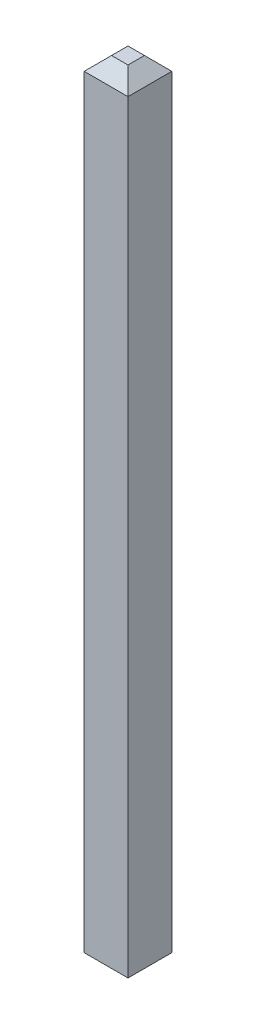
ISO-10303-21;
HEADER;
FILE_DESCRIPTION(('STEP AP214'),'2;1');
FILE_NAME('part.step','',(''),(''),'','','');
FILE_SCHEMA(('AUTOMOTIVE_DESIGN { 1 0 10303 214 1 1 1 1 }'));
ENDSEC;
DATA;
#1=APPLICATION_CONTEXT('core data for automotive mechanical design processes');
#2=APPLICATION_PROTOCOL_DEFINITION('international standard','automotive_design',2000,#1);
#3=PRODUCT_CONTEXT('',#1,'mechanical');
#4=PRODUCT('Part','Part','',(#3));
#5=PRODUCT_RELATED_PRODUCT_CATEGORY('part','',(#4));
#6=PRODUCT_DEFINITION_FORMATION('','',#4);
#7=PRODUCT_DEFINITION_CONTEXT('part definition',#1,'design');
#8=PRODUCT_DEFINITION('design','',#6,#7);
#9=PRODUCT_DEFINITION_SHAPE('','',#8);
#10=(LENGTH_UNIT() NAMED_UNIT(*) SI_UNIT(.MILLI.,.METRE.));
#11=(NAMED_UNIT(*) PLANE_ANGLE_UNIT() SI_UNIT($,.RADIAN.));
#12=(NAMED_UNIT(*) SI_UNIT($,.STERADIAN.) SOLID_ANGLE_UNIT());
#13=UNCERTAINTY_MEASURE_WITH_UNIT(LENGTH_MEASURE(1.E-05),#10,'distance_accuracy_value','');
#14=(GEOMETRIC_REPRESENTATION_CONTEXT(3) GLOBAL_UNCERTAINTY_ASSIGNED_CONTEXT((#13)) GLOBAL_UNIT_ASSIGNED_CONTEXT((#10,
#11,#12)) REPRESENTATION_CONTEXT('',''));
#15=CARTESIAN_POINT('',(0.,0.,0.));
#16=DIRECTION('',(0.,0.,1.));
#17=DIRECTION('',(1.,0.,0.));
#18=AXIS2_PLACEMENT_3D('',#15,#16,#17);
#19=CARTESIAN_POINT('',(-0.95,7.07,-0.32));
#20=DIRECTION('',(-0.707106781186548,-0.707106781186548,0.));
#21=DIRECTION('',(-0.707106781186548,0.707106781186548,0.));
#22=AXIS2_PLACEMENT_3D('',#19,#20,#21);
#23=PLANE('',#22);
#24=DIRECTION('',(0.577350269189626,-0.577350269189626,0.577350269189626));
#25=VECTOR('',#24,1.);
#26=CARTESIAN_POINT('',(-1.163333333333,7.283333333333,0.106666666667));
#27=LINE('',#26,#25);
#28=CARTESIAN_POINT('',(-1.15,7.27,0.12));
#29=VERTEX_POINT('',#28);
#30=CARTESIAN_POINT('',(-0.95,7.07,0.32));
#31=VERTEX_POINT('',#30);
#32=EDGE_CURVE('E190',#29,#31,#27,.T.);
#33=ORIENTED_EDGE('',*,*,#32,.T.);
#34=DIRECTION('',(0.,0.,1.));
#35=VECTOR('',#34,1.);
#36=CARTESIAN_POINT('',(-0.95,7.07,-0.32));
#37=LINE('',#36,#35);
#38=CARTESIAN_POINT('',(-0.95,7.07,-0.32));
#39=VERTEX_POINT('',#38);
#40=EDGE_CURVE('E80',#39,#31,#37,.T.);
#41=ORIENTED_EDGE('',*,*,#40,.F.);
#42=DIRECTION('',(0.577350269189626,-0.577350269189626,-0.577350269189626));
#43=VECTOR('',#42,1.);
#44=CARTESIAN_POINT('',(-0.95,7.07,-0.32));
#45=LINE('',#44,#43);
#46=CARTESIAN_POINT('',(-1.15,7.27,-0.12));
#47=VERTEX_POINT('',#46);
#48=EDGE_CURVE('E11',#47,#39,#45,.T.);
#49=ORIENTED_EDGE('',*,*,#48,.F.);
#50=DIRECTION('',(0.,0.,-1.));
#51=VECTOR('',#50,1.);
#52=CARTESIAN_POINT('',(-1.15,7.27,-0.32));
#53=LINE('',#52,#51);
#54=EDGE_CURVE('E129',#29,#47,#53,.T.);
#55=ORIENTED_EDGE('',*,*,#54,.F.);
#56=EDGE_LOOP('',(#33,#41,#49,#55));
#57=FACE_BOUND('',#56,.T.);
#58=ADVANCED_FACE('F16',(#57),#23,.F.);
#59=CARTESIAN_POINT('',(-1.27,7.07,-0.32));
#60=DIRECTION('',(0.,0.707106781186548,-0.707106781186548));
#61=DIRECTION('',(-1.,0.,0.));
#62=AXIS2_PLACEMENT_3D('',#59,#60,#61);
#63=PLANE('',#62);
#64=DIRECTION('',(0.577350269189626,0.577350269189626,0.577350269189626));
#65=VECTOR('',#64,1.);
#66=CARTESIAN_POINT('',(-1.456666666667,7.203333333333,-0.186666666667));
#67=LINE('',#66,#65);
#68=CARTESIAN_POINT('',(-1.59,7.07,-0.32));
#69=VERTEX_POINT('',#68);
#70=CARTESIAN_POINT('',(-1.39,7.27,-0.12));
#71=VERTEX_POINT('',#70);
#72=EDGE_CURVE('E26',#69,#71,#67,.T.);
#73=ORIENTED_EDGE('',*,*,#72,.T.);
#74=DIRECTION('',(-1.,0.,0.));
#75=VECTOR('',#74,1.);
#76=CARTESIAN_POINT('',(-1.59,7.27,-0.12));
#77=LINE('',#76,#75);
#78=EDGE_CURVE('E132',#47,#71,#77,.T.);
#79=ORIENTED_EDGE('',*,*,#78,.F.);
#80=ORIENTED_EDGE('',*,*,#48,.T.);
#81=DIRECTION('',(1.,0.,0.));
#82=VECTOR('',#81,1.);
#83=CARTESIAN_POINT('',(-0.95,7.07,-0.32));
#84=LINE('',#83,#82);
#85=EDGE_CURVE('E149',#69,#39,#84,.T.);
#86=ORIENTED_EDGE('',*,*,#85,.F.);
#87=EDGE_LOOP('',(#73,#79,#80,#86));
#88=FACE_BOUND('',#87,.T.);
#89=ADVANCED_FACE('F238',(#88),#63,.T.);
#90=CARTESIAN_POINT('',(-1.39,7.27,-0.32));
#91=DIRECTION('',(0.707106781186548,-0.707106781186548,0.));
#92=DIRECTION('',(0.,0.,-1.));
#93=AXIS2_PLACEMENT_3D('',#90,#91,#92);
#94=PLANE('',#93);
#95=DIRECTION('',(-0.577350269189626,-0.577350269189626,0.577350269189626));
#96=VECTOR('',#95,1.);
#97=CARTESIAN_POINT('',(-1.456666666667,7.203333333333,0.186666666667));
#98=LINE('',#97,#96);
#99=CARTESIAN_POINT('',(-1.39,7.27,0.12));
#100=VERTEX_POINT('',#99);
#101=CARTESIAN_POINT('',(-1.59,7.07,0.32));
#102=VERTEX_POINT('',#101);
#103=EDGE_CURVE('E39',#100,#102,#98,.T.);
#104=ORIENTED_EDGE('',*,*,#103,.F.);
#105=DIRECTION('',(0.,0.,1.));
#106=VECTOR('',#105,1.);
#107=CARTESIAN_POINT('',(-1.39,7.27,-0.32));
#108=LINE('',#107,#106);
#109=EDGE_CURVE('E144',#71,#100,#108,.T.);
#110=ORIENTED_EDGE('',*,*,#109,.F.);
#111=ORIENTED_EDGE('',*,*,#72,.F.);
#112=DIRECTION('',(0.,0.,-1.));
#113=VECTOR('',#112,1.);
#114=CARTESIAN_POINT('',(-1.59,7.07,-0.32));
#115=LINE('',#114,#113);
#116=EDGE_CURVE('E163',#102,#69,#115,.T.);
#117=ORIENTED_EDGE('',*,*,#116,.F.);
#118=EDGE_LOOP('',(#104,#110,#111,#117));
#119=FACE_BOUND('',#118,.T.);
#120=ADVANCED_FACE('F249',(#119),#94,.F.);
#121=CARTESIAN_POINT('',(-1.59,7.27,0.12));
#122=DIRECTION('',(0.,-0.707106781186548,-0.707106781186548));
#123=DIRECTION('',(0.,-0.707106781186548,0.707106781186548));
#124=AXIS2_PLACEMENT_3D('',#121,#122,#123);
#125=PLANE('',#124);
#126=ORIENTED_EDGE('',*,*,#32,.F.);
#127=DIRECTION('',(1.,0.,0.));
#128=VECTOR('',#127,1.);
#129=CARTESIAN_POINT('',(-1.59,7.27,0.12));
#130=LINE('',#129,#128);
#131=EDGE_CURVE('E125',#100,#29,#130,.T.);
#132=ORIENTED_EDGE('',*,*,#131,.F.);
#133=ORIENTED_EDGE('',*,*,#103,.T.);
#134=DIRECTION('',(-1.,0.,0.));
#135=VECTOR('',#134,1.);
#136=CARTESIAN_POINT('',(-1.27,7.07,0.32));
#137=LINE('',#136,#135);
#138=EDGE_CURVE('E86',#31,#102,#137,.T.);
#139=ORIENTED_EDGE('',*,*,#138,.F.);
#140=EDGE_LOOP('',(#126,#132,#133,#139));
#141=FACE_BOUND('',#140,.T.);
#142=ADVANCED_FACE('F241',(#141),#125,.F.);
#143=CARTESIAN_POINT('',(-1.59,7.27,-0.32));
#144=DIRECTION('',(0.,-1.,0.));
#145=DIRECTION('',(0.,0.,-1.));
#146=AXIS2_PLACEMENT_3D('',#143,#144,#145);
#147=PLANE('',#146);
#148=ORIENTED_EDGE('',*,*,#54,.T.);
#149=ORIENTED_EDGE('',*,*,#78,.T.);
#150=ORIENTED_EDGE('',*,*,#109,.T.);
#151=ORIENTED_EDGE('',*,*,#131,.T.);
#152=EDGE_LOOP('',(#148,#149,#150,#151));
#153=FACE_BOUND('',#152,.T.);
#154=ADVANCED_FACE('F239',(#153),#147,.F.);
#155=CARTESIAN_POINT('',(-0.95,7.27,-0.32));
#156=DIRECTION('',(-1.,0.,0.));
#157=DIRECTION('',(0.,1.,0.));
#158=AXIS2_PLACEMENT_3D('',#155,#156,#157);
#159=PLANE('',#158);
#160=DIRECTION('',(0.,-1.,0.));
#161=VECTOR('',#160,1.);
#162=CARTESIAN_POINT('',(-0.95,7.27,-0.32));
#163=LINE('',#162,#161);
#164=CARTESIAN_POINT('',(-0.95,-4.07,-0.32));
#165=VERTEX_POINT('',#164);
#166=EDGE_CURVE('E175',#39,#165,#163,.T.);
#167=ORIENTED_EDGE('',*,*,#166,.F.);
#168=ORIENTED_EDGE('',*,*,#40,.T.);
#169=DIRECTION('',(0.,-1.,0.));
#170=VECTOR('',#169,1.);
#171=CARTESIAN_POINT('',(-0.95,7.27,0.32));
#172=LINE('',#171,#170);
#173=CARTESIAN_POINT('',(-0.95,-4.07,0.32));
#174=VERTEX_POINT('',#173);
#175=EDGE_CURVE('E72',#31,#174,#172,.T.);
#176=ORIENTED_EDGE('',*,*,#175,.T.);
#177=DIRECTION('',(0.,0.,-1.));
#178=VECTOR('',#177,1.);
#179=CARTESIAN_POINT('',(-0.95,-4.07,-0.32));
#180=LINE('',#179,#178);
#181=EDGE_CURVE('E77',#174,#165,#180,.T.);
#182=ORIENTED_EDGE('',*,*,#181,.T.);
#183=EDGE_LOOP('',(#167,#168,#176,#182));
#184=FACE_BOUND('',#183,.T.);
#185=ADVANCED_FACE('F75',(#184),#159,.F.);
#186=CARTESIAN_POINT('',(-1.27,1.5,0.32));
#187=DIRECTION('',(0.,0.,-1.));
#188=DIRECTION('',(0.,-1.,0.));
#189=AXIS2_PLACEMENT_3D('',#186,#187,#188);
#190=PLANE('',#189);
#191=ORIENTED_EDGE('',*,*,#175,.F.);
#192=ORIENTED_EDGE('',*,*,#138,.T.);
#193=DIRECTION('',(0.,1.,0.));
#194=VECTOR('',#193,1.);
#195=CARTESIAN_POINT('',(-1.59,-4.27,0.32));
#196=LINE('',#195,#194);
#197=CARTESIAN_POINT('',(-1.59,-4.07,0.32));
#198=VERTEX_POINT('',#197);
#199=EDGE_CURVE('E105',#198,#102,#196,.T.);
#200=ORIENTED_EDGE('',*,*,#199,.F.);
#201=DIRECTION('',(1.,0.,0.));
#202=VECTOR('',#201,1.);
#203=CARTESIAN_POINT('',(-1.27,-4.07,0.32));
#204=LINE('',#203,#202);
#205=EDGE_CURVE('E19',#198,#174,#204,.T.);
#206=ORIENTED_EDGE('',*,*,#205,.T.);
#207=EDGE_LOOP('',(#191,#192,#200,#206));
#208=FACE_BOUND('',#207,.T.);
#209=ADVANCED_FACE('F103',(#208),#190,.F.);
#210=CARTESIAN_POINT('',(-1.15,-4.27,-0.32));
#211=DIRECTION('',(-0.707106781186548,0.707106781186548,0.));
#212=DIRECTION('',(0.,0.,1.));
#213=AXIS2_PLACEMENT_3D('',#210,#211,#212);
#214=PLANE('',#213);
#215=DIRECTION('',(-0.577350269189626,-0.577350269189626,0.577350269189626));
#216=VECTOR('',#215,1.);
#217=CARTESIAN_POINT('',(-1.083333333333,-4.203333333333,-0.186666666667));
#218=LINE('',#217,#216);
#219=CARTESIAN_POINT('',(-1.15,-4.27,-0.12));
#220=VERTEX_POINT('',#219);
#221=EDGE_CURVE('E98',#165,#220,#218,.T.);
#222=ORIENTED_EDGE('',*,*,#221,.F.);
#223=ORIENTED_EDGE('',*,*,#181,.F.);
#224=DIRECTION('',(-0.577350269189626,-0.577350269189626,-0.577350269189626));
#225=VECTOR('',#224,1.);
#226=CARTESIAN_POINT('',(-1.296666666667,-4.416666666667,-0.02666666666667));
#227=LINE('',#226,#225);
#228=CARTESIAN_POINT('',(-1.15,-4.27,0.12));
#229=VERTEX_POINT('',#228);
#230=EDGE_CURVE('E95',#174,#229,#227,.T.);
#231=ORIENTED_EDGE('',*,*,#230,.T.);
#232=DIRECTION('',(0.,0.,1.));
#233=VECTOR('',#232,1.);
#234=CARTESIAN_POINT('',(-1.15,-4.27,-0.32));
#235=LINE('',#234,#233);
#236=EDGE_CURVE('E127',#220,#229,#235,.T.);
#237=ORIENTED_EDGE('',*,*,#236,.F.);
#238=EDGE_LOOP('',(#222,#223,#231,#237));
#239=FACE_BOUND('',#238,.T.);
#240=ADVANCED_FACE('F91',(#239),#214,.F.);
#241=CARTESIAN_POINT('',(-0.95,-4.27,0.12));
#242=DIRECTION('',(0.,0.707106781186548,-0.707106781186548));
#243=DIRECTION('',(-1.,0.,0.));
#244=AXIS2_PLACEMENT_3D('',#241,#242,#243);
#245=PLANE('',#244);
#246=ORIENTED_EDGE('',*,*,#230,.F.);
#247=ORIENTED_EDGE('',*,*,#205,.F.);
#248=DIRECTION('',(-0.577350269189626,0.577350269189626,0.577350269189626));
#249=VECTOR('',#248,1.);
#250=CARTESIAN_POINT('',(-1.376666666667,-4.283333333333,0.106666666667));
#251=LINE('',#250,#249);
#252=CARTESIAN_POINT('',(-1.39,-4.27,0.12));
#253=VERTEX_POINT('',#252);
#254=EDGE_CURVE('E115',#253,#198,#251,.T.);
#255=ORIENTED_EDGE('',*,*,#254,.F.);
#256=DIRECTION('',(-1.,0.,0.));
#257=VECTOR('',#256,1.);
#258=CARTESIAN_POINT('',(-0.95,-4.27,0.12));
#259=LINE('',#258,#257);
#260=EDGE_CURVE('E112',#229,#253,#259,.T.);
#261=ORIENTED_EDGE('',*,*,#260,.F.);
#262=EDGE_LOOP('',(#246,#247,#255,#261));
#263=FACE_BOUND('',#262,.T.);
#264=ADVANCED_FACE('F110',(#263),#245,.F.);
#265=CARTESIAN_POINT('',(-1.59,-4.07,-0.32));
#266=DIRECTION('',(0.707106781186548,0.707106781186548,0.));
#267=DIRECTION('',(0.,0.,-1.));
#268=AXIS2_PLACEMENT_3D('',#265,#266,#267);
#269=PLANE('',#268);
#270=DIRECTION('',(0.577350269189626,-0.577350269189626,0.577350269189626));
#271=VECTOR('',#270,1.);
#272=CARTESIAN_POINT('',(-1.483333333333,-4.176666666667,-0.213333333333));
#273=LINE('',#272,#271);
#274=CARTESIAN_POINT('',(-1.59,-4.07,-0.32));
#275=VERTEX_POINT('',#274);
#276=CARTESIAN_POINT('',(-1.39,-4.27,-0.12));
#277=VERTEX_POINT('',#276);
#278=EDGE_CURVE('E140',#275,#277,#273,.T.);
#279=ORIENTED_EDGE('',*,*,#278,.T.);
#280=DIRECTION('',(0.,0.,-1.));
#281=VECTOR('',#280,1.);
#282=CARTESIAN_POINT('',(-1.39,-4.27,-0.32));
#283=LINE('',#282,#281);
#284=EDGE_CURVE('E150',#253,#277,#283,.T.);
#285=ORIENTED_EDGE('',*,*,#284,.F.);
#286=ORIENTED_EDGE('',*,*,#254,.T.);
#287=DIRECTION('',(0.,0.,1.));
#288=VECTOR('',#287,1.);
#289=CARTESIAN_POINT('',(-1.59,-4.07,-0.32));
#290=LINE('',#289,#288);
#291=EDGE_CURVE('E121',#275,#198,#290,.T.);
#292=ORIENTED_EDGE('',*,*,#291,.F.);
#293=EDGE_LOOP('',(#279,#285,#286,#292));
#294=FACE_BOUND('',#293,.T.);
#295=ADVANCED_FACE('F211',(#294),#269,.F.);
#296=CARTESIAN_POINT('',(-1.59,-4.27,-0.32));
#297=DIRECTION('',(1.,0.,0.));
#298=DIRECTION('',(0.,0.,1.));
#299=AXIS2_PLACEMENT_3D('',#296,#297,#298);
#300=PLANE('',#299);
#301=ORIENTED_EDGE('',*,*,#199,.T.);
#302=ORIENTED_EDGE('',*,*,#116,.T.);
#303=DIRECTION('',(0.,1.,0.));
#304=VECTOR('',#303,1.);
#305=CARTESIAN_POINT('',(-1.59,-4.27,-0.32));
#306=LINE('',#305,#304);
#307=EDGE_CURVE('E145',#275,#69,#306,.T.);
#308=ORIENTED_EDGE('',*,*,#307,.F.);
#309=ORIENTED_EDGE('',*,*,#291,.T.);
#310=EDGE_LOOP('',(#301,#302,#308,#309));
#311=FACE_BOUND('',#310,.T.);
#312=ADVANCED_FACE('F267',(#311),#300,.F.);
#313=CARTESIAN_POINT('',(-1.27,1.5,-0.32));
#314=DIRECTION('',(0.,0.,-1.));
#315=DIRECTION('',(0.,-1.,0.));
#316=AXIS2_PLACEMENT_3D('',#313,#314,#315);
#317=PLANE('',#316);
#318=ORIENTED_EDGE('',*,*,#307,.T.);
#319=ORIENTED_EDGE('',*,*,#85,.T.);
#320=ORIENTED_EDGE('',*,*,#166,.T.);
#321=DIRECTION('',(-1.,0.,0.));
#322=VECTOR('',#321,1.);
#323=CARTESIAN_POINT('',(-1.59,-4.07,-0.32));
#324=LINE('',#323,#322);
#325=EDGE_CURVE('E136',#165,#275,#324,.T.);
#326=ORIENTED_EDGE('',*,*,#325,.T.);
#327=EDGE_LOOP('',(#318,#319,#320,#326));
#328=FACE_BOUND('',#327,.T.);
#329=ADVANCED_FACE('F272',(#328),#317,.T.);
#330=CARTESIAN_POINT('',(-1.27,-4.07,-0.32));
#331=DIRECTION('',(0.,-0.707106781186548,-0.707106781186548));
#332=DIRECTION('',(0.,-0.707106781186548,0.707106781186548));
#333=AXIS2_PLACEMENT_3D('',#330,#331,#332);
#334=PLANE('',#333);
#335=ORIENTED_EDGE('',*,*,#278,.F.);
#336=ORIENTED_EDGE('',*,*,#325,.F.);
#337=ORIENTED_EDGE('',*,*,#221,.T.);
#338=DIRECTION('',(1.,0.,0.));
#339=VECTOR('',#338,1.);
#340=CARTESIAN_POINT('',(-0.95,-4.27,-0.12));
#341=LINE('',#340,#339);
#342=EDGE_CURVE('E154',#277,#220,#341,.T.);
#343=ORIENTED_EDGE('',*,*,#342,.F.);
#344=EDGE_LOOP('',(#335,#336,#337,#343));
#345=FACE_BOUND('',#344,.T.);
#346=ADVANCED_FACE('F215',(#345),#334,.T.);
#347=CARTESIAN_POINT('',(-0.95,-4.27,-0.32));
#348=DIRECTION('',(0.,1.,0.));
#349=DIRECTION('',(0.,0.,-1.));
#350=AXIS2_PLACEMENT_3D('',#347,#348,#349);
#351=PLANE('',#350);
#352=ORIENTED_EDGE('',*,*,#236,.T.);
#353=ORIENTED_EDGE('',*,*,#260,.T.);
#354=ORIENTED_EDGE('',*,*,#284,.T.);
#355=ORIENTED_EDGE('',*,*,#342,.T.);
#356=EDGE_LOOP('',(#352,#353,#354,#355));
#357=FACE_BOUND('',#356,.T.);
#358=ADVANCED_FACE('F217',(#357),#351,.F.);
#359=CLOSED_SHELL('',(#58,#89,#120,#142,#154,#185,#209,#240,#264,#295,#312,#329,#346,#358));
#360=MANIFOLD_SOLID_BREP('B1',#359);
#361=ADVANCED_BREP_SHAPE_REPRESENTATION('',(#18,#360),#14);
#362=SHAPE_DEFINITION_REPRESENTATION(#9,#361);
ENDSEC;
END-ISO-10303-21;
